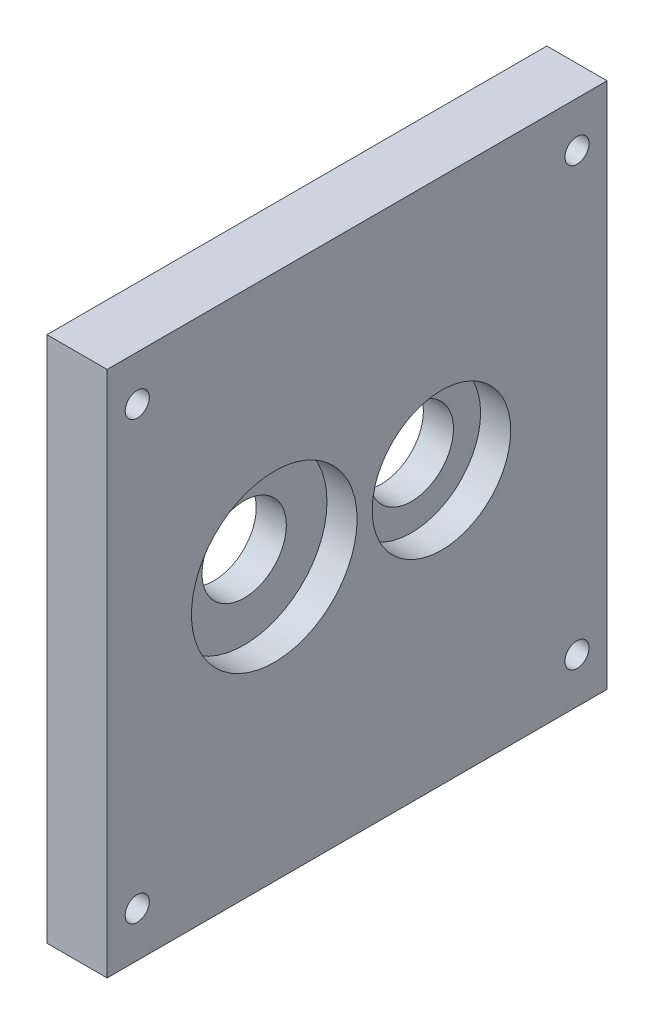
ISO-10303-21;
HEADER;
FILE_DESCRIPTION(('STEP AP214'),'2;1');
FILE_NAME('part.step','',(''),(''),'','','');
FILE_SCHEMA(('AUTOMOTIVE_DESIGN { 1 0 10303 214 1 1 1 1 }'));
ENDSEC;
DATA;
#1=APPLICATION_CONTEXT('core data for automotive mechanical design processes');
#2=APPLICATION_PROTOCOL_DEFINITION('international standard','automotive_design',2000,#1);
#3=PRODUCT_CONTEXT('',#1,'mechanical');
#4=PRODUCT('Part','Part','',(#3));
#5=PRODUCT_RELATED_PRODUCT_CATEGORY('part','',(#4));
#6=PRODUCT_DEFINITION_FORMATION('','',#4);
#7=PRODUCT_DEFINITION_CONTEXT('part definition',#1,'design');
#8=PRODUCT_DEFINITION('design','',#6,#7);
#9=PRODUCT_DEFINITION_SHAPE('','',#8);
#10=(LENGTH_UNIT() NAMED_UNIT(*) SI_UNIT(.MILLI.,.METRE.));
#11=(NAMED_UNIT(*) PLANE_ANGLE_UNIT() SI_UNIT($,.RADIAN.));
#12=(NAMED_UNIT(*) SI_UNIT($,.STERADIAN.) SOLID_ANGLE_UNIT());
#13=UNCERTAINTY_MEASURE_WITH_UNIT(LENGTH_MEASURE(1.E-05),#10,'distance_accuracy_value','');
#14=(GEOMETRIC_REPRESENTATION_CONTEXT(3) GLOBAL_UNCERTAINTY_ASSIGNED_CONTEXT((#13)) GLOBAL_UNIT_ASSIGNED_CONTEXT((#10,
#11,#12)) REPRESENTATION_CONTEXT('',''));
#15=CARTESIAN_POINT('',(0.,0.,0.));
#16=DIRECTION('',(0.,0.,1.));
#17=DIRECTION('',(1.,0.,0.));
#18=AXIS2_PLACEMENT_3D('',#15,#16,#17);
#19=CARTESIAN_POINT('',(-165.,90.5,-28.));
#20=DIRECTION('',(1.,0.,0.));
#21=DIRECTION('',(0.,0.,-1.));
#22=AXIS2_PLACEMENT_3D('',#19,#20,#21);
#23=CYLINDRICAL_SURFACE('',#22,14.);
#24=CARTESIAN_POINT('',(-9.99999999999998,90.5,-28.));
#25=DIRECTION('',(1.,0.,0.));
#26=DIRECTION('',(0.,0.,-1.));
#27=AXIS2_PLACEMENT_3D('',#24,#25,#26);
#28=CIRCLE('',#27,14.);
#29=CARTESIAN_POINT('',(-9.99999999999998,90.5,-42.));
#30=VERTEX_POINT('',#29);
#31=EDGE_CURVE('E126',#30,#30,#28,.T.);
#32=ORIENTED_EDGE('',*,*,#31,.F.);
#33=EDGE_LOOP('',(#32));
#34=FACE_BOUND('',#33,.T.);
#35=CARTESIAN_POINT('',(0.,90.5,-28.));
#36=DIRECTION('',(1.,0.,0.));
#37=DIRECTION('',(0.,0.,-1.));
#38=AXIS2_PLACEMENT_3D('',#35,#36,#37);
#39=CIRCLE('',#38,14.);
#40=CARTESIAN_POINT('',(0.,90.5,-42.));
#41=VERTEX_POINT('',#40);
#42=EDGE_CURVE('E42',#41,#41,#39,.F.);
#43=ORIENTED_EDGE('',*,*,#42,.F.);
#44=EDGE_LOOP('',(#43));
#45=FACE_BOUND('',#44,.T.);
#46=ADVANCED_FACE('F38',(#34,#45),#23,.F.);
#47=CARTESIAN_POINT('',(-165.,90.5,27.5));
#48=DIRECTION('',(1.,0.,0.));
#49=DIRECTION('',(0.,0.,-1.));
#50=AXIS2_PLACEMENT_3D('',#47,#48,#49);
#51=CYLINDRICAL_SURFACE('',#50,14.);
#52=CARTESIAN_POINT('',(-9.99999999999998,90.5,27.5));
#53=DIRECTION('',(1.,0.,0.));
#54=DIRECTION('',(0.,0.,-1.));
#55=AXIS2_PLACEMENT_3D('',#52,#53,#54);
#56=CIRCLE('',#55,14.);
#57=CARTESIAN_POINT('',(-9.99999999999998,90.5,13.5));
#58=VERTEX_POINT('',#57);
#59=EDGE_CURVE('E115',#58,#58,#56,.T.);
#60=ORIENTED_EDGE('',*,*,#59,.F.);
#61=EDGE_LOOP('',(#60));
#62=FACE_BOUND('',#61,.T.);
#63=CARTESIAN_POINT('',(0.,90.5,27.5));
#64=DIRECTION('',(1.,0.,0.));
#65=DIRECTION('',(0.,0.,-1.));
#66=AXIS2_PLACEMENT_3D('',#63,#64,#65);
#67=CIRCLE('',#66,14.);
#68=CARTESIAN_POINT('',(0.,90.5,13.5));
#69=VERTEX_POINT('',#68);
#70=EDGE_CURVE('E132',#69,#69,#67,.F.);
#71=ORIENTED_EDGE('',*,*,#70,.F.);
#72=EDGE_LOOP('',(#71));
#73=FACE_BOUND('',#72,.T.);
#74=ADVANCED_FACE('F198',(#62,#73),#51,.F.);
#75=CARTESIAN_POINT('',(10.,175.,-83.));
#76=DIRECTION('',(-1.,0.,0.));
#77=DIRECTION('',(0.,0.,1.));
#78=AXIS2_PLACEMENT_3D('',#75,#76,#77);
#79=PLANE('',#78);
#80=CARTESIAN_POINT('',(10.,160.,73.));
#81=DIRECTION('',(1.,0.,0.));
#82=DIRECTION('',(0.,0.,1.));
#83=AXIS2_PLACEMENT_3D('',#80,#81,#82);
#84=CIRCLE('',#83,4.00000000000001);
#85=CARTESIAN_POINT('',(10.,160.,77.));
#86=VERTEX_POINT('',#85);
#87=EDGE_CURVE('E169',#86,#86,#84,.T.);
#88=ORIENTED_EDGE('',*,*,#87,.F.);
#89=EDGE_LOOP('',(#88));
#90=FACE_BOUND('',#89,.T.);
#91=CARTESIAN_POINT('',(10.,15.,73.));
#92=DIRECTION('',(1.,0.,0.));
#93=DIRECTION('',(0.,0.,-1.));
#94=AXIS2_PLACEMENT_3D('',#91,#92,#93);
#95=CIRCLE('',#94,4.00000000000001);
#96=CARTESIAN_POINT('',(10.,15.,69.));
#97=VERTEX_POINT('',#96);
#98=EDGE_CURVE('E175',#97,#97,#95,.T.);
#99=ORIENTED_EDGE('',*,*,#98,.F.);
#100=EDGE_LOOP('',(#99));
#101=FACE_BOUND('',#100,.T.);
#102=CARTESIAN_POINT('',(10.,15.,-73.));
#103=DIRECTION('',(1.,0.,0.));
#104=DIRECTION('',(0.,0.,1.));
#105=AXIS2_PLACEMENT_3D('',#102,#103,#104);
#106=CIRCLE('',#105,4.00000000000001);
#107=CARTESIAN_POINT('',(10.,15.,-69.));
#108=VERTEX_POINT('',#107);
#109=EDGE_CURVE('E181',#108,#108,#106,.T.);
#110=ORIENTED_EDGE('',*,*,#109,.F.);
#111=EDGE_LOOP('',(#110));
#112=FACE_BOUND('',#111,.T.);
#113=CARTESIAN_POINT('',(10.,160.,-73.));
#114=DIRECTION('',(1.,0.,0.));
#115=DIRECTION('',(0.,0.,-1.));
#116=AXIS2_PLACEMENT_3D('',#113,#114,#115);
#117=CIRCLE('',#116,4.00000000000001);
#118=CARTESIAN_POINT('',(10.,160.,-77.));
#119=VERTEX_POINT('',#118);
#120=EDGE_CURVE('E151',#119,#119,#117,.T.);
#121=ORIENTED_EDGE('',*,*,#120,.F.);
#122=EDGE_LOOP('',(#121));
#123=FACE_BOUND('',#122,.T.);
#124=CARTESIAN_POINT('',(10.,90.5,27.5));
#125=DIRECTION('',(1.,0.,0.));
#126=DIRECTION('',(0.,0.,-1.));
#127=AXIS2_PLACEMENT_3D('',#124,#125,#126);
#128=CIRCLE('',#127,27.5);
#129=CARTESIAN_POINT('',(10.,90.5,0.));
#130=VERTEX_POINT('',#129);
#131=EDGE_CURVE('E142',#130,#130,#128,.T.);
#132=ORIENTED_EDGE('',*,*,#131,.F.);
#133=EDGE_LOOP('',(#132));
#134=FACE_BOUND('',#133,.T.);
#135=CARTESIAN_POINT('',(10.,90.5,-28.));
#136=DIRECTION('',(1.,0.,0.));
#137=DIRECTION('',(0.,0.,-1.));
#138=AXIS2_PLACEMENT_3D('',#135,#136,#137);
#139=CIRCLE('',#138,23.);
#140=CARTESIAN_POINT('',(10.,90.5,-51.));
#141=VERTEX_POINT('',#140);
#142=EDGE_CURVE('E157',#141,#141,#139,.T.);
#143=ORIENTED_EDGE('',*,*,#142,.F.);
#144=EDGE_LOOP('',(#143));
#145=FACE_BOUND('',#144,.T.);
#146=DIRECTION('',(0.,0.,-1.));
#147=VECTOR('',#146,1.);
#148=CARTESIAN_POINT('',(10.,0.,-83.));
#149=LINE('',#148,#147);
#150=CARTESIAN_POINT('',(10.,0.,83.));
#151=VERTEX_POINT('',#150);
#152=CARTESIAN_POINT('',(10.,0.,-83.));
#153=VERTEX_POINT('',#152);
#154=EDGE_CURVE('E111',#151,#153,#149,.T.);
#155=ORIENTED_EDGE('',*,*,#154,.T.);
#156=DIRECTION('',(0.,-1.,0.));
#157=VECTOR('',#156,1.);
#158=CARTESIAN_POINT('',(10.,175.,-83.));
#159=LINE('',#158,#157);
#160=CARTESIAN_POINT('',(10.,175.,-83.));
#161=VERTEX_POINT('',#160);
#162=EDGE_CURVE('E11',#161,#153,#159,.T.);
#163=ORIENTED_EDGE('',*,*,#162,.F.);
#164=DIRECTION('',(0.,0.,-1.));
#165=VECTOR('',#164,1.);
#166=CARTESIAN_POINT('',(10.,175.,-83.));
#167=LINE('',#166,#165);
#168=CARTESIAN_POINT('',(10.,175.,83.));
#169=VERTEX_POINT('',#168);
#170=EDGE_CURVE('E93',#169,#161,#167,.T.);
#171=ORIENTED_EDGE('',*,*,#170,.F.);
#172=DIRECTION('',(0.,-1.,0.));
#173=VECTOR('',#172,1.);
#174=CARTESIAN_POINT('',(10.,175.,83.));
#175=LINE('',#174,#173);
#176=EDGE_CURVE('E107',#169,#151,#175,.T.);
#177=ORIENTED_EDGE('',*,*,#176,.T.);
#178=EDGE_LOOP('',(#155,#163,#171,#177));
#179=FACE_BOUND('',#178,.T.);
#180=ADVANCED_FACE('F40',(#90,#101,#112,#123,#134,#145,#179),#79,.F.);
#181=CARTESIAN_POINT('',(10.,175.,-83.));
#182=DIRECTION('',(0.,0.,1.));
#183=DIRECTION('',(1.,0.,0.));
#184=AXIS2_PLACEMENT_3D('',#181,#182,#183);
#185=PLANE('',#184);
#186=DIRECTION('',(-1.,0.,0.));
#187=VECTOR('',#186,1.);
#188=CARTESIAN_POINT('',(10.,0.,-83.));
#189=LINE('',#188,#187);
#190=CARTESIAN_POINT('',(-9.99999999999998,0.,-83.));
#191=VERTEX_POINT('',#190);
#192=EDGE_CURVE('E98',#153,#191,#189,.T.);
#193=ORIENTED_EDGE('',*,*,#192,.T.);
#194=DIRECTION('',(0.,-1.,0.));
#195=VECTOR('',#194,1.);
#196=CARTESIAN_POINT('',(-9.99999999999998,175.,-83.));
#197=LINE('',#196,#195);
#198=CARTESIAN_POINT('',(-9.99999999999998,175.,-83.));
#199=VERTEX_POINT('',#198);
#200=EDGE_CURVE('E49',#199,#191,#197,.T.);
#201=ORIENTED_EDGE('',*,*,#200,.F.);
#202=DIRECTION('',(-1.,0.,0.));
#203=VECTOR('',#202,1.);
#204=CARTESIAN_POINT('',(10.,175.,-83.));
#205=LINE('',#204,#203);
#206=EDGE_CURVE('E88',#161,#199,#205,.T.);
#207=ORIENTED_EDGE('',*,*,#206,.F.);
#208=ORIENTED_EDGE('',*,*,#162,.T.);
#209=EDGE_LOOP('',(#193,#201,#207,#208));
#210=FACE_BOUND('',#209,.T.);
#211=ADVANCED_FACE('F97',(#210),#185,.F.);
#212=CARTESIAN_POINT('',(-9.99999999999998,175.,-83.));
#213=DIRECTION('',(1.,0.,0.));
#214=DIRECTION('',(0.,0.,-1.));
#215=AXIS2_PLACEMENT_3D('',#212,#213,#214);
#216=PLANE('',#215);
#217=CARTESIAN_POINT('',(-9.99999999999998,160.,73.));
#218=DIRECTION('',(1.,0.,0.));
#219=DIRECTION('',(0.,0.,1.));
#220=AXIS2_PLACEMENT_3D('',#217,#218,#219);
#221=CIRCLE('',#220,4.00000000000001);
#222=CARTESIAN_POINT('',(-9.99999999999998,160.,77.));
#223=VERTEX_POINT('',#222);
#224=EDGE_CURVE('E172',#223,#223,#221,.T.);
#225=ORIENTED_EDGE('',*,*,#224,.T.);
#226=EDGE_LOOP('',(#225));
#227=FACE_BOUND('',#226,.T.);
#228=CARTESIAN_POINT('',(-9.99999999999998,15.,73.));
#229=DIRECTION('',(1.,0.,0.));
#230=DIRECTION('',(0.,0.,-1.));
#231=AXIS2_PLACEMENT_3D('',#228,#229,#230);
#232=CIRCLE('',#231,4.00000000000001);
#233=CARTESIAN_POINT('',(-9.99999999999998,15.,69.));
#234=VERTEX_POINT('',#233);
#235=EDGE_CURVE('E178',#234,#234,#232,.T.);
#236=ORIENTED_EDGE('',*,*,#235,.T.);
#237=EDGE_LOOP('',(#236));
#238=FACE_BOUND('',#237,.T.);
#239=CARTESIAN_POINT('',(-9.99999999999998,15.,-73.));
#240=DIRECTION('',(1.,0.,0.));
#241=DIRECTION('',(0.,0.,1.));
#242=AXIS2_PLACEMENT_3D('',#239,#240,#241);
#243=CIRCLE('',#242,4.00000000000001);
#244=CARTESIAN_POINT('',(-9.99999999999998,15.,-69.));
#245=VERTEX_POINT('',#244);
#246=EDGE_CURVE('E167',#245,#245,#243,.T.);
#247=ORIENTED_EDGE('',*,*,#246,.T.);
#248=EDGE_LOOP('',(#247));
#249=FACE_BOUND('',#248,.T.);
#250=CARTESIAN_POINT('',(-9.99999999999998,160.,-73.));
#251=DIRECTION('',(1.,0.,0.));
#252=DIRECTION('',(0.,0.,-1.));
#253=AXIS2_PLACEMENT_3D('',#250,#251,#252);
#254=CIRCLE('',#253,4.00000000000001);
#255=CARTESIAN_POINT('',(-9.99999999999998,160.,-77.));
#256=VERTEX_POINT('',#255);
#257=EDGE_CURVE('E159',#256,#256,#254,.T.);
#258=ORIENTED_EDGE('',*,*,#257,.T.);
#259=EDGE_LOOP('',(#258));
#260=FACE_BOUND('',#259,.T.);
#261=ORIENTED_EDGE('',*,*,#59,.T.);
#262=EDGE_LOOP('',(#261));
#263=FACE_BOUND('',#262,.T.);
#264=ORIENTED_EDGE('',*,*,#31,.T.);
#265=EDGE_LOOP('',(#264));
#266=FACE_BOUND('',#265,.T.);
#267=DIRECTION('',(0.,0.,1.));
#268=VECTOR('',#267,1.);
#269=CARTESIAN_POINT('',(-9.99999999999998,0.,-83.));
#270=LINE('',#269,#268);
#271=CARTESIAN_POINT('',(-9.99999999999998,0.,83.));
#272=VERTEX_POINT('',#271);
#273=EDGE_CURVE('E75',#191,#272,#270,.T.);
#274=ORIENTED_EDGE('',*,*,#273,.T.);
#275=DIRECTION('',(0.,-1.,0.));
#276=VECTOR('',#275,1.);
#277=CARTESIAN_POINT('',(-9.99999999999998,175.,83.));
#278=LINE('',#277,#276);
#279=CARTESIAN_POINT('',(-9.99999999999998,175.,83.));
#280=VERTEX_POINT('',#279);
#281=EDGE_CURVE('E100',#280,#272,#278,.T.);
#282=ORIENTED_EDGE('',*,*,#281,.F.);
#283=DIRECTION('',(0.,0.,1.));
#284=VECTOR('',#283,1.);
#285=CARTESIAN_POINT('',(-9.99999999999998,175.,-83.));
#286=LINE('',#285,#284);
#287=EDGE_CURVE('E91',#199,#280,#286,.T.);
#288=ORIENTED_EDGE('',*,*,#287,.F.);
#289=ORIENTED_EDGE('',*,*,#200,.T.);
#290=EDGE_LOOP('',(#274,#282,#288,#289));
#291=FACE_BOUND('',#290,.T.);
#292=ADVANCED_FACE('F102',(#227,#238,#249,#260,#263,#266,#291),#216,.F.);
#293=CARTESIAN_POINT('',(10.,175.,83.));
#294=DIRECTION('',(0.,0.,-1.));
#295=DIRECTION('',(-1.,0.,0.));
#296=AXIS2_PLACEMENT_3D('',#293,#294,#295);
#297=PLANE('',#296);
#298=DIRECTION('',(1.,0.,0.));
#299=VECTOR('',#298,1.);
#300=CARTESIAN_POINT('',(10.,0.,83.));
#301=LINE('',#300,#299);
#302=EDGE_CURVE('E81',#272,#151,#301,.T.);
#303=ORIENTED_EDGE('',*,*,#302,.T.);
#304=ORIENTED_EDGE('',*,*,#176,.F.);
#305=DIRECTION('',(1.,0.,0.));
#306=VECTOR('',#305,1.);
#307=CARTESIAN_POINT('',(10.,175.,83.));
#308=LINE('',#307,#306);
#309=EDGE_CURVE('E58',#280,#169,#308,.T.);
#310=ORIENTED_EDGE('',*,*,#309,.F.);
#311=ORIENTED_EDGE('',*,*,#281,.T.);
#312=EDGE_LOOP('',(#303,#304,#310,#311));
#313=FACE_BOUND('',#312,.T.);
#314=ADVANCED_FACE('F217',(#313),#297,.F.);
#315=CARTESIAN_POINT('',(0.,175.,0.));
#316=DIRECTION('',(0.,-1.,0.));
#317=DIRECTION('',(0.,0.,-1.));
#318=AXIS2_PLACEMENT_3D('',#315,#316,#317);
#319=PLANE('',#318);
#320=ORIENTED_EDGE('',*,*,#170,.T.);
#321=ORIENTED_EDGE('',*,*,#206,.T.);
#322=ORIENTED_EDGE('',*,*,#287,.T.);
#323=ORIENTED_EDGE('',*,*,#309,.T.);
#324=EDGE_LOOP('',(#320,#321,#322,#323));
#325=FACE_BOUND('',#324,.T.);
#326=ADVANCED_FACE('F89',(#325),#319,.F.);
#327=CARTESIAN_POINT('',(0.,0.,0.));
#328=DIRECTION('',(0.,-1.,0.));
#329=DIRECTION('',(0.,0.,-1.));
#330=AXIS2_PLACEMENT_3D('',#327,#328,#329);
#331=PLANE('',#330);
#332=ORIENTED_EDGE('',*,*,#154,.F.);
#333=ORIENTED_EDGE('',*,*,#302,.F.);
#334=ORIENTED_EDGE('',*,*,#273,.F.);
#335=ORIENTED_EDGE('',*,*,#192,.F.);
#336=EDGE_LOOP('',(#332,#333,#334,#335));
#337=FACE_BOUND('',#336,.T.);
#338=ADVANCED_FACE('F207',(#337),#331,.T.);
#339=CARTESIAN_POINT('',(0.,90.5,27.5));
#340=DIRECTION('',(1.,0.,0.));
#341=DIRECTION('',(0.,0.,-1.));
#342=AXIS2_PLACEMENT_3D('',#339,#340,#341);
#343=PLANE('',#342);
#344=CARTESIAN_POINT('',(0.,90.5,27.5));
#345=DIRECTION('',(1.,0.,0.));
#346=DIRECTION('',(0.,0.,-1.));
#347=AXIS2_PLACEMENT_3D('',#344,#345,#346);
#348=CIRCLE('',#347,27.5);
#349=CARTESIAN_POINT('',(0.,90.5,0.));
#350=VERTEX_POINT('',#349);
#351=EDGE_CURVE('E135',#350,#350,#348,.T.);
#352=ORIENTED_EDGE('',*,*,#351,.T.);
#353=EDGE_LOOP('',(#352));
#354=FACE_BOUND('',#353,.T.);
#355=ORIENTED_EDGE('',*,*,#70,.T.);
#356=EDGE_LOOP('',(#355));
#357=FACE_BOUND('',#356,.T.);
#358=ADVANCED_FACE('F209',(#354,#357),#343,.T.);
#359=CARTESIAN_POINT('',(0.,90.5,27.5));
#360=DIRECTION('',(1.,0.,0.));
#361=DIRECTION('',(0.,0.,-1.));
#362=AXIS2_PLACEMENT_3D('',#359,#360,#361);
#363=CYLINDRICAL_SURFACE('',#362,27.5);
#364=ORIENTED_EDGE('',*,*,#351,.F.);
#365=EDGE_LOOP('',(#364));
#366=FACE_BOUND('',#365,.T.);
#367=ORIENTED_EDGE('',*,*,#131,.T.);
#368=EDGE_LOOP('',(#367));
#369=FACE_BOUND('',#368,.T.);
#370=ADVANCED_FACE('F215',(#366,#369),#363,.F.);
#371=CARTESIAN_POINT('',(0.,90.5,-28.));
#372=DIRECTION('',(1.,0.,0.));
#373=DIRECTION('',(0.,0.,-1.));
#374=AXIS2_PLACEMENT_3D('',#371,#372,#373);
#375=PLANE('',#374);
#376=CARTESIAN_POINT('',(0.,90.5,-28.));
#377=DIRECTION('',(1.,0.,0.));
#378=DIRECTION('',(0.,0.,-1.));
#379=AXIS2_PLACEMENT_3D('',#376,#377,#378);
#380=CIRCLE('',#379,23.);
#381=CARTESIAN_POINT('',(0.,90.5,-51.));
#382=VERTEX_POINT('',#381);
#383=EDGE_CURVE('E148',#382,#382,#380,.T.);
#384=ORIENTED_EDGE('',*,*,#383,.T.);
#385=EDGE_LOOP('',(#384));
#386=FACE_BOUND('',#385,.T.);
#387=ORIENTED_EDGE('',*,*,#42,.T.);
#388=EDGE_LOOP('',(#387));
#389=FACE_BOUND('',#388,.T.);
#390=ADVANCED_FACE('F234',(#386,#389),#375,.T.);
#391=CARTESIAN_POINT('',(0.,90.5,-28.));
#392=DIRECTION('',(1.,0.,0.));
#393=DIRECTION('',(0.,0.,-1.));
#394=AXIS2_PLACEMENT_3D('',#391,#392,#393);
#395=CYLINDRICAL_SURFACE('',#394,23.);
#396=ORIENTED_EDGE('',*,*,#383,.F.);
#397=EDGE_LOOP('',(#396));
#398=FACE_BOUND('',#397,.T.);
#399=ORIENTED_EDGE('',*,*,#142,.T.);
#400=EDGE_LOOP('',(#399));
#401=FACE_BOUND('',#400,.T.);
#402=ADVANCED_FACE('F231',(#398,#401),#395,.F.);
#403=CARTESIAN_POINT('',(-9.99999999999998,160.,-73.));
#404=DIRECTION('',(1.,0.,0.));
#405=DIRECTION('',(0.,0.,-1.));
#406=AXIS2_PLACEMENT_3D('',#403,#404,#405);
#407=CYLINDRICAL_SURFACE('',#406,4.00000000000001);
#408=ORIENTED_EDGE('',*,*,#257,.F.);
#409=EDGE_LOOP('',(#408));
#410=FACE_BOUND('',#409,.T.);
#411=ORIENTED_EDGE('',*,*,#120,.T.);
#412=EDGE_LOOP('',(#411));
#413=FACE_BOUND('',#412,.T.);
#414=ADVANCED_FACE('F192',(#410,#413),#407,.F.);
#415=CARTESIAN_POINT('',(-9.99999999999998,15.,-73.));
#416=DIRECTION('',(1.,0.,0.));
#417=DIRECTION('',(0.,0.,-1.));
#418=AXIS2_PLACEMENT_3D('',#415,#416,#417);
#419=CYLINDRICAL_SURFACE('',#418,4.00000000000001);
#420=ORIENTED_EDGE('',*,*,#246,.F.);
#421=EDGE_LOOP('',(#420));
#422=FACE_BOUND('',#421,.T.);
#423=ORIENTED_EDGE('',*,*,#109,.T.);
#424=EDGE_LOOP('',(#423));
#425=FACE_BOUND('',#424,.T.);
#426=ADVANCED_FACE('F188',(#422,#425),#419,.F.);
#427=CARTESIAN_POINT('',(-9.99999999999998,15.,73.));
#428=DIRECTION('',(1.,0.,0.));
#429=DIRECTION('',(0.,0.,-1.));
#430=AXIS2_PLACEMENT_3D('',#427,#428,#429);
#431=CYLINDRICAL_SURFACE('',#430,4.00000000000001);
#432=ORIENTED_EDGE('',*,*,#235,.F.);
#433=EDGE_LOOP('',(#432));
#434=FACE_BOUND('',#433,.T.);
#435=ORIENTED_EDGE('',*,*,#98,.T.);
#436=EDGE_LOOP('',(#435));
#437=FACE_BOUND('',#436,.T.);
#438=ADVANCED_FACE('F191',(#434,#437),#431,.F.);
#439=CARTESIAN_POINT('',(-9.99999999999998,160.,73.));
#440=DIRECTION('',(1.,0.,0.));
#441=DIRECTION('',(0.,0.,-1.));
#442=AXIS2_PLACEMENT_3D('',#439,#440,#441);
#443=CYLINDRICAL_SURFACE('',#442,4.00000000000001);
#444=ORIENTED_EDGE('',*,*,#224,.F.);
#445=EDGE_LOOP('',(#444));
#446=FACE_BOUND('',#445,.T.);
#447=ORIENTED_EDGE('',*,*,#87,.T.);
#448=EDGE_LOOP('',(#447));
#449=FACE_BOUND('',#448,.T.);
#450=ADVANCED_FACE('F245',(#446,#449),#443,.F.);
#451=CLOSED_SHELL('',(#46,#74,#180,#211,#292,#314,#326,#338,#358,#370,#390,#402,#414,#426,#438,#450));
#452=MANIFOLD_SOLID_BREP('B2',#451);
#453=ADVANCED_BREP_SHAPE_REPRESENTATION('',(#18,#452),#14);
#454=SHAPE_DEFINITION_REPRESENTATION(#9,#453);
ENDSEC;
END-ISO-10303-21;
